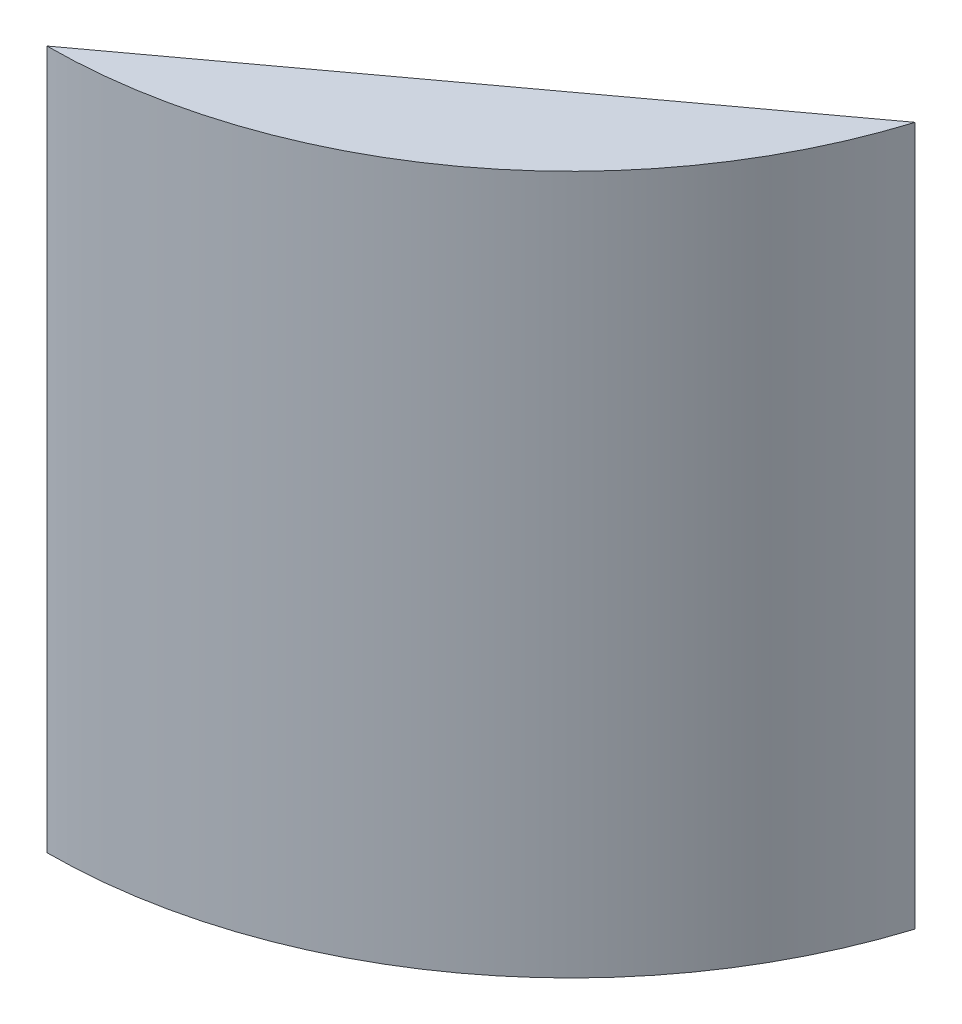
ISO-10303-21;
HEADER;
FILE_DESCRIPTION(('STEP AP214'),'2;1');
FILE_NAME('part.step','',(''),(''),'','','');
FILE_SCHEMA(('AUTOMOTIVE_DESIGN { 1 0 10303 214 1 1 1 1 }'));
ENDSEC;
DATA;
#1=APPLICATION_CONTEXT('core data for automotive mechanical design processes');
#2=APPLICATION_PROTOCOL_DEFINITION('international standard','automotive_design',2000,#1);
#3=PRODUCT_CONTEXT('',#1,'mechanical');
#4=PRODUCT('Part','Part','',(#3));
#5=PRODUCT_RELATED_PRODUCT_CATEGORY('part','',(#4));
#6=PRODUCT_DEFINITION_FORMATION('','',#4);
#7=PRODUCT_DEFINITION_CONTEXT('part definition',#1,'design');
#8=PRODUCT_DEFINITION('design','',#6,#7);
#9=PRODUCT_DEFINITION_SHAPE('','',#8);
#10=(LENGTH_UNIT() NAMED_UNIT(*) SI_UNIT(.MILLI.,.METRE.));
#11=(NAMED_UNIT(*) PLANE_ANGLE_UNIT() SI_UNIT($,.RADIAN.));
#12=(NAMED_UNIT(*) SI_UNIT($,.STERADIAN.) SOLID_ANGLE_UNIT());
#13=UNCERTAINTY_MEASURE_WITH_UNIT(LENGTH_MEASURE(1.E-05),#10,'distance_accuracy_value','');
#14=(GEOMETRIC_REPRESENTATION_CONTEXT(3) GLOBAL_UNCERTAINTY_ASSIGNED_CONTEXT((#13)) GLOBAL_UNIT_ASSIGNED_CONTEXT((#10,
#11,#12)) REPRESENTATION_CONTEXT('',''));
#15=CARTESIAN_POINT('',(0.,0.,0.));
#16=DIRECTION('',(0.,0.,1.));
#17=DIRECTION('',(1.,0.,0.));
#18=AXIS2_PLACEMENT_3D('',#15,#16,#17);
#19=CARTESIAN_POINT('',(0.,114.3,0.));
#20=DIRECTION('',(0.,-1.,0.));
#21=DIRECTION('',(0.,0.,-1.));
#22=AXIS2_PLACEMENT_3D('',#19,#20,#21);
#23=CYLINDRICAL_SURFACE('',#22,85.725);
#24=CARTESIAN_POINT('',(0.,114.3,0.));
#25=DIRECTION('',(0.,1.,0.));
#26=DIRECTION('',(0.,0.,1.));
#27=AXIS2_PLACEMENT_3D('',#24,#25,#26);
#28=CIRCLE('',#27,85.725);
#29=CARTESIAN_POINT('',(0.,114.3,85.725));
#30=VERTEX_POINT('',#29);
#31=CARTESIAN_POINT('',(81.8390377098757,114.3,25.5175925925926));
#32=VERTEX_POINT('',#31);
#33=EDGE_CURVE('E43',#30,#32,#28,.T.);
#34=ORIENTED_EDGE('',*,*,#33,.F.);
#35=DIRECTION('',(0.,1.,0.));
#36=VECTOR('',#35,1.);
#37=CARTESIAN_POINT('',(0.,-38.1,85.725));
#38=LINE('',#37,#36);
#39=CARTESIAN_POINT('',(0.,0.,85.725));
#40=VERTEX_POINT('',#39);
#41=EDGE_CURVE('E57',#40,#30,#38,.T.);
#42=ORIENTED_EDGE('',*,*,#41,.F.);
#43=CARTESIAN_POINT('',(0.,0.,0.));
#44=DIRECTION('',(0.,1.,0.));
#45=DIRECTION('',(0.,0.,1.));
#46=AXIS2_PLACEMENT_3D('',#43,#44,#45);
#47=CIRCLE('',#46,85.725);
#48=CARTESIAN_POINT('',(81.8390377098757,0.,25.5175925925926));
#49=VERTEX_POINT('',#48);
#50=EDGE_CURVE('E71',#40,#49,#47,.T.);
#51=ORIENTED_EDGE('',*,*,#50,.T.);
#52=DIRECTION('',(0.,1.,0.));
#53=VECTOR('',#52,1.);
#54=CARTESIAN_POINT('',(81.8390377098757,-38.1,25.5175925925926));
#55=LINE('',#54,#53);
#56=EDGE_CURVE('E50',#49,#32,#55,.T.);
#57=ORIENTED_EDGE('',*,*,#56,.T.);
#58=EDGE_LOOP('',(#34,#42,#51,#57));
#59=FACE_BOUND('',#58,.T.);
#60=ADVANCED_FACE('F36',(#59),#23,.T.);
#61=CARTESIAN_POINT('',(0.,114.3,0.));
#62=DIRECTION('',(0.,1.,0.));
#63=DIRECTION('',(0.,0.,1.));
#64=AXIS2_PLACEMENT_3D('',#61,#62,#63);
#65=PLANE('',#64);
#66=DIRECTION('',(0.805502339664131,0.,-0.592592592592593));
#67=VECTOR('',#66,1.);
#68=CARTESIAN_POINT('',(0.,114.3,85.725));
#69=LINE('',#68,#67);
#70=EDGE_CURVE('E60',#30,#32,#69,.T.);
#71=ORIENTED_EDGE('',*,*,#70,.F.);
#72=ORIENTED_EDGE('',*,*,#33,.T.);
#73=EDGE_LOOP('',(#71,#72));
#74=FACE_BOUND('',#73,.T.);
#75=ADVANCED_FACE('F68',(#74),#65,.T.);
#76=CARTESIAN_POINT('',(0.,0.,0.));
#77=DIRECTION('',(0.,1.,0.));
#78=DIRECTION('',(0.,0.,1.));
#79=AXIS2_PLACEMENT_3D('',#76,#77,#78);
#80=PLANE('',#79);
#81=CARTESIAN_POINT('',(45.8597594274689,0.,62.336492182002));
#82=DIRECTION('',(0.,-1.,0.));
#83=DIRECTION('',(0.,0.,-1.));
#84=AXIS2_PLACEMENT_3D('',#81,#82,#83);
#85=CIRCLE('',#84,5.588);
#86=CARTESIAN_POINT('',(45.8597594274689,0.,56.748492182002));
#87=VERTEX_POINT('',#86);
#88=EDGE_CURVE('E123',#87,#87,#85,.T.);
#89=ORIENTED_EDGE('',*,*,#88,.F.);
#90=EDGE_LOOP('',(#89));
#91=FACE_BOUND('',#90,.T.);
#92=ORIENTED_EDGE('',*,*,#50,.F.);
#93=DIRECTION('',(0.805502339664131,0.,-0.592592592592593));
#94=VECTOR('',#93,1.);
#95=CARTESIAN_POINT('',(40.9195188549379,0.,55.6212962962963));
#96=LINE('',#95,#94);
#97=EDGE_CURVE('E11',#40,#49,#96,.T.);
#98=ORIENTED_EDGE('',*,*,#97,.T.);
#99=EDGE_LOOP('',(#92,#98));
#100=FACE_BOUND('',#99,.T.);
#101=ADVANCED_FACE('F138',(#91,#100),#80,.F.);
#102=CARTESIAN_POINT('',(0.,-38.1,85.725));
#103=DIRECTION('',(0.592592592592593,0.,0.805502339664131));
#104=DIRECTION('',(0.805502339664131,0.,-0.592592592592593));
#105=AXIS2_PLACEMENT_3D('',#102,#103,#104);
#106=PLANE('',#105);
#107=CARTESIAN_POINT('',(70.5861700247678,51.308,33.7961111111111));
#108=DIRECTION('',(-0.592592592592593,0.,-0.805502339664131));
#109=DIRECTION('',(-0.805502339664131,0.,0.592592592592593));
#110=AXIS2_PLACEMENT_3D('',#107,#108,#109);
#111=CIRCLE('',#110,2.778125);
#112=CARTESIAN_POINT('',(68.3483838373884,51.308,35.4424074074074));
#113=VERTEX_POINT('',#112);
#114=EDGE_CURVE('E93',#113,#113,#111,.T.);
#115=ORIENTED_EDGE('',*,*,#114,.F.);
#116=EDGE_LOOP('',(#115));
#117=FACE_BOUND('',#116,.T.);
#118=CARTESIAN_POINT('',(31.9172247068516,70.358,62.2441111111111));
#119=DIRECTION('',(-0.592592592592593,0.,-0.805502339664131));
#120=DIRECTION('',(-0.805502339664131,0.,0.592592592592593));
#121=AXIS2_PLACEMENT_3D('',#118,#119,#120);
#122=CIRCLE('',#121,2.778125);
#123=CARTESIAN_POINT('',(29.6794385194722,70.358,63.8904074074074));
#124=VERTEX_POINT('',#123);
#125=EDGE_CURVE('E100',#124,#124,#122,.T.);
#126=ORIENTED_EDGE('',*,*,#125,.F.);
#127=EDGE_LOOP('',(#126));
#128=FACE_BOUND('',#127,.T.);
#129=CARTESIAN_POINT('',(70.5861700247679,70.358,33.7961111111111));
#130=DIRECTION('',(-0.592592592592593,0.,-0.805502339664131));
#131=DIRECTION('',(-0.805502339664131,0.,0.592592592592593));
#132=AXIS2_PLACEMENT_3D('',#129,#130,#131);
#133=CIRCLE('',#132,2.778125);
#134=CARTESIAN_POINT('',(68.3483838373884,70.358,35.4424074074074));
#135=VERTEX_POINT('',#134);
#136=EDGE_CURVE('E81',#135,#135,#133,.T.);
#137=ORIENTED_EDGE('',*,*,#136,.F.);
#138=EDGE_LOOP('',(#137));
#139=FACE_BOUND('',#138,.T.);
#140=CARTESIAN_POINT('',(31.9172247068516,95.758,62.2441111111111));
#141=DIRECTION('',(-0.592592592592593,0.,-0.805502339664131));
#142=DIRECTION('',(-0.805502339664131,0.,0.592592592592593));
#143=AXIS2_PLACEMENT_3D('',#140,#141,#142);
#144=CIRCLE('',#143,2.778125);
#145=CARTESIAN_POINT('',(29.6794385194721,95.758,63.8904074074074));
#146=VERTEX_POINT('',#145);
#147=EDGE_CURVE('E88',#146,#146,#144,.T.);
#148=ORIENTED_EDGE('',*,*,#147,.F.);
#149=EDGE_LOOP('',(#148));
#150=FACE_BOUND('',#149,.T.);
#151=CARTESIAN_POINT('',(36.0091765923453,30.48,59.2337407407408));
#152=DIRECTION('',(-0.592592592592593,0.,-0.805502339664131));
#153=DIRECTION('',(-0.805502339664131,0.,0.592592592592593));
#154=AXIS2_PLACEMENT_3D('',#151,#152,#153);
#155=CIRCLE('',#154,2.778125);
#156=CARTESIAN_POINT('',(33.7713904049659,30.48,60.880037037037));
#157=VERTEX_POINT('',#156);
#158=EDGE_CURVE('E117',#157,#157,#155,.T.);
#159=ORIENTED_EDGE('',*,*,#158,.F.);
#160=EDGE_LOOP('',(#159));
#161=FACE_BOUND('',#160,.T.);
#162=CARTESIAN_POINT('',(70.5861700247678,30.48,33.7961111111111));
#163=DIRECTION('',(-0.592592592592593,0.,-0.805502339664131));
#164=DIRECTION('',(-0.805502339664131,0.,0.592592592592593));
#165=AXIS2_PLACEMENT_3D('',#162,#163,#164);
#166=CIRCLE('',#165,2.77812499999999);
#167=CARTESIAN_POINT('',(68.3483838373884,30.48,35.4424074074074));
#168=VERTEX_POINT('',#167);
#169=EDGE_CURVE('E105',#168,#168,#166,.T.);
#170=ORIENTED_EDGE('',*,*,#169,.F.);
#171=EDGE_LOOP('',(#170));
#172=FACE_BOUND('',#171,.T.);
#173=CARTESIAN_POINT('',(36.0091765923453,51.308,59.2337407407408));
#174=DIRECTION('',(-0.592592592592593,0.,-0.805502339664131));
#175=DIRECTION('',(-0.805502339664131,0.,0.592592592592593));
#176=AXIS2_PLACEMENT_3D('',#173,#174,#175);
#177=CIRCLE('',#176,2.778125);
#178=CARTESIAN_POINT('',(33.7713904049659,51.308,60.8800370370371));
#179=VERTEX_POINT('',#178);
#180=EDGE_CURVE('E112',#179,#179,#177,.T.);
#181=ORIENTED_EDGE('',*,*,#180,.F.);
#182=EDGE_LOOP('',(#181));
#183=FACE_BOUND('',#182,.T.);
#184=CARTESIAN_POINT('',(70.5861700247678,95.758,33.7961111111111));
#185=DIRECTION('',(-0.592592592592593,0.,-0.805502339664131));
#186=DIRECTION('',(-0.805502339664131,0.,0.592592592592593));
#187=AXIS2_PLACEMENT_3D('',#184,#185,#186);
#188=CIRCLE('',#187,2.77812499999999);
#189=CARTESIAN_POINT('',(68.3483838373884,95.758,35.4424074074074));
#190=VERTEX_POINT('',#189);
#191=EDGE_CURVE('E75',#190,#190,#188,.T.);
#192=ORIENTED_EDGE('',*,*,#191,.F.);
#193=EDGE_LOOP('',(#192));
#194=FACE_BOUND('',#193,.T.);
#195=ORIENTED_EDGE('',*,*,#41,.T.);
#196=ORIENTED_EDGE('',*,*,#70,.T.);
#197=ORIENTED_EDGE('',*,*,#56,.F.);
#198=ORIENTED_EDGE('',*,*,#97,.F.);
#199=EDGE_LOOP('',(#195,#196,#197,#198));
#200=FACE_BOUND('',#199,.T.);
#201=ADVANCED_FACE('F59',(#117,#128,#139,#150,#161,#172,#183,#194,#200),#106,.F.);
#202=CARTESIAN_POINT('',(72.4676515062493,95.758,36.3535810395447));
#203=DIRECTION('',(-0.592592592592593,0.,-0.805502339664131));
#204=DIRECTION('',(-0.805502339664131,0.,0.592592592592593));
#205=AXIS2_PLACEMENT_3D('',#202,#203,#204);
#206=CYLINDRICAL_SURFACE('',#205,2.77812499999999);
#207=CARTESIAN_POINT('',(72.4676515062493,95.758,36.3535810395447));
#208=DIRECTION('',(-0.592592592592593,0.,-0.805502339664131));
#209=DIRECTION('',(-0.805502339664131,0.,0.592592592592593));
#210=AXIS2_PLACEMENT_3D('',#207,#208,#209);
#211=CIRCLE('',#210,2.77812499999999);
#212=CARTESIAN_POINT('',(70.2298653188699,95.758,37.999877335841));
#213=VERTEX_POINT('',#212);
#214=EDGE_CURVE('E69',#213,#213,#211,.T.);
#215=ORIENTED_EDGE('',*,*,#214,.F.);
#216=EDGE_LOOP('',(#215));
#217=FACE_BOUND('',#216,.T.);
#218=ORIENTED_EDGE('',*,*,#191,.T.);
#219=EDGE_LOOP('',(#218));
#220=FACE_BOUND('',#219,.T.);
#221=ADVANCED_FACE('F145',(#217,#220),#206,.F.);
#222=CARTESIAN_POINT('',(72.4676515062493,95.758,36.3535810395447));
#223=DIRECTION('',(-0.592592592592593,0.,-0.805502339664131));
#224=DIRECTION('',(-0.805502339664131,0.,0.592592592592593));
#225=AXIS2_PLACEMENT_3D('',#222,#223,#224);
#226=PLANE('',#225);
#227=ORIENTED_EDGE('',*,*,#214,.T.);
#228=EDGE_LOOP('',(#227));
#229=FACE_BOUND('',#228,.T.);
#230=ADVANCED_FACE('F172',(#229),#226,.T.);
#231=CARTESIAN_POINT('',(37.8906580738268,51.308,61.7912106691744));
#232=DIRECTION('',(-0.592592592592593,0.,-0.805502339664131));
#233=DIRECTION('',(-0.805502339664131,0.,0.592592592592593));
#234=AXIS2_PLACEMENT_3D('',#231,#232,#233);
#235=CYLINDRICAL_SURFACE('',#234,2.778125);
#236=CARTESIAN_POINT('',(37.8906580738268,51.308,61.7912106691744));
#237=DIRECTION('',(-0.592592592592593,0.,-0.805502339664131));
#238=DIRECTION('',(-0.805502339664131,0.,0.592592592592593));
#239=AXIS2_PLACEMENT_3D('',#236,#237,#238);
#240=CIRCLE('',#239,2.778125);
#241=CARTESIAN_POINT('',(35.6528718864474,51.308,63.4375069654707));
#242=VERTEX_POINT('',#241);
#243=EDGE_CURVE('E97',#242,#242,#240,.T.);
#244=ORIENTED_EDGE('',*,*,#243,.F.);
#245=EDGE_LOOP('',(#244));
#246=FACE_BOUND('',#245,.T.);
#247=ORIENTED_EDGE('',*,*,#180,.T.);
#248=EDGE_LOOP('',(#247));
#249=FACE_BOUND('',#248,.T.);
#250=ADVANCED_FACE('F182',(#246,#249),#235,.F.);
#251=CARTESIAN_POINT('',(37.8906580738268,51.308,61.7912106691744));
#252=DIRECTION('',(-0.592592592592593,0.,-0.805502339664131));
#253=DIRECTION('',(-0.805502339664131,0.,0.592592592592593));
#254=AXIS2_PLACEMENT_3D('',#251,#252,#253);
#255=PLANE('',#254);
#256=ORIENTED_EDGE('',*,*,#243,.T.);
#257=EDGE_LOOP('',(#256));
#258=FACE_BOUND('',#257,.T.);
#259=ADVANCED_FACE('F192',(#258),#255,.T.);
#260=CARTESIAN_POINT('',(72.4676515062493,30.48,36.3535810395447));
#261=DIRECTION('',(-0.592592592592593,0.,-0.805502339664131));
#262=DIRECTION('',(-0.805502339664131,0.,0.592592592592593));
#263=AXIS2_PLACEMENT_3D('',#260,#261,#262);
#264=CYLINDRICAL_SURFACE('',#263,2.77812499999999);
#265=CARTESIAN_POINT('',(72.4676515062493,30.48,36.3535810395447));
#266=DIRECTION('',(-0.592592592592593,0.,-0.805502339664131));
#267=DIRECTION('',(-0.805502339664131,0.,0.592592592592593));
#268=AXIS2_PLACEMENT_3D('',#265,#266,#267);
#269=CIRCLE('',#268,2.77812499999999);
#270=CARTESIAN_POINT('',(70.2298653188699,30.48,37.999877335841));
#271=VERTEX_POINT('',#270);
#272=EDGE_CURVE('E108',#271,#271,#269,.T.);
#273=ORIENTED_EDGE('',*,*,#272,.F.);
#274=EDGE_LOOP('',(#273));
#275=FACE_BOUND('',#274,.T.);
#276=ORIENTED_EDGE('',*,*,#169,.T.);
#277=EDGE_LOOP('',(#276));
#278=FACE_BOUND('',#277,.T.);
#279=ADVANCED_FACE('F202',(#275,#278),#264,.F.);
#280=CARTESIAN_POINT('',(72.4676515062493,30.48,36.3535810395447));
#281=DIRECTION('',(-0.592592592592593,0.,-0.805502339664131));
#282=DIRECTION('',(-0.805502339664131,0.,0.592592592592593));
#283=AXIS2_PLACEMENT_3D('',#280,#281,#282);
#284=PLANE('',#283);
#285=ORIENTED_EDGE('',*,*,#272,.T.);
#286=EDGE_LOOP('',(#285));
#287=FACE_BOUND('',#286,.T.);
#288=ADVANCED_FACE('F212',(#287),#284,.T.);
#289=CARTESIAN_POINT('',(37.8906580738268,30.48,61.7912106691744));
#290=DIRECTION('',(-0.592592592592593,0.,-0.805502339664131));
#291=DIRECTION('',(-0.805502339664131,0.,0.592592592592593));
#292=AXIS2_PLACEMENT_3D('',#289,#290,#291);
#293=CYLINDRICAL_SURFACE('',#292,2.778125);
#294=CARTESIAN_POINT('',(37.8906580738268,30.48,61.7912106691744));
#295=DIRECTION('',(-0.592592592592593,0.,-0.805502339664131));
#296=DIRECTION('',(-0.805502339664131,0.,0.592592592592593));
#297=AXIS2_PLACEMENT_3D('',#294,#295,#296);
#298=CIRCLE('',#297,2.778125);
#299=CARTESIAN_POINT('',(35.6528718864474,30.48,63.4375069654707));
#300=VERTEX_POINT('',#299);
#301=EDGE_CURVE('E109',#300,#300,#298,.T.);
#302=ORIENTED_EDGE('',*,*,#301,.F.);
#303=EDGE_LOOP('',(#302));
#304=FACE_BOUND('',#303,.T.);
#305=ORIENTED_EDGE('',*,*,#158,.T.);
#306=EDGE_LOOP('',(#305));
#307=FACE_BOUND('',#306,.T.);
#308=ADVANCED_FACE('F222',(#304,#307),#293,.F.);
#309=CARTESIAN_POINT('',(37.8906580738268,30.48,61.7912106691744));
#310=DIRECTION('',(-0.592592592592593,0.,-0.805502339664131));
#311=DIRECTION('',(-0.805502339664131,0.,0.592592592592593));
#312=AXIS2_PLACEMENT_3D('',#309,#310,#311);
#313=PLANE('',#312);
#314=ORIENTED_EDGE('',*,*,#301,.T.);
#315=EDGE_LOOP('',(#314));
#316=FACE_BOUND('',#315,.T.);
#317=ADVANCED_FACE('F232',(#316),#313,.T.);
#318=CARTESIAN_POINT('',(33.798706188333,95.758,64.8015810395448));
#319=DIRECTION('',(-0.592592592592593,0.,-0.805502339664131));
#320=DIRECTION('',(-0.805502339664131,0.,0.592592592592593));
#321=AXIS2_PLACEMENT_3D('',#318,#319,#320);
#322=CYLINDRICAL_SURFACE('',#321,2.778125);
#323=CARTESIAN_POINT('',(33.798706188333,95.758,64.8015810395448));
#324=DIRECTION('',(-0.592592592592593,0.,-0.805502339664131));
#325=DIRECTION('',(-0.805502339664131,0.,0.592592592592593));
#326=AXIS2_PLACEMENT_3D('',#323,#324,#325);
#327=CIRCLE('',#326,2.778125);
#328=CARTESIAN_POINT('',(31.5609200009536,95.758,66.4478773358411));
#329=VERTEX_POINT('',#328);
#330=EDGE_CURVE('E78',#329,#329,#327,.T.);
#331=ORIENTED_EDGE('',*,*,#330,.F.);
#332=EDGE_LOOP('',(#331));
#333=FACE_BOUND('',#332,.T.);
#334=ORIENTED_EDGE('',*,*,#147,.T.);
#335=EDGE_LOOP('',(#334));
#336=FACE_BOUND('',#335,.T.);
#337=ADVANCED_FACE('F242',(#333,#336),#322,.F.);
#338=CARTESIAN_POINT('',(33.798706188333,95.758,64.8015810395448));
#339=DIRECTION('',(-0.592592592592593,0.,-0.805502339664131));
#340=DIRECTION('',(-0.805502339664131,0.,0.592592592592593));
#341=AXIS2_PLACEMENT_3D('',#338,#339,#340);
#342=PLANE('',#341);
#343=ORIENTED_EDGE('',*,*,#330,.T.);
#344=EDGE_LOOP('',(#343));
#345=FACE_BOUND('',#344,.T.);
#346=ADVANCED_FACE('F252',(#345),#342,.T.);
#347=CARTESIAN_POINT('',(72.4676515062493,70.358,36.3535810395447));
#348=DIRECTION('',(-0.592592592592593,0.,-0.805502339664131));
#349=DIRECTION('',(-0.805502339664131,0.,0.592592592592593));
#350=AXIS2_PLACEMENT_3D('',#347,#348,#349);
#351=CYLINDRICAL_SURFACE('',#350,2.778125);
#352=CARTESIAN_POINT('',(72.4676515062493,70.358,36.3535810395447));
#353=DIRECTION('',(-0.592592592592593,0.,-0.805502339664131));
#354=DIRECTION('',(-0.805502339664131,0.,0.592592592592593));
#355=AXIS2_PLACEMENT_3D('',#352,#353,#354);
#356=CIRCLE('',#355,2.778125);
#357=CARTESIAN_POINT('',(70.2298653188699,70.358,37.999877335841));
#358=VERTEX_POINT('',#357);
#359=EDGE_CURVE('E84',#358,#358,#356,.T.);
#360=ORIENTED_EDGE('',*,*,#359,.F.);
#361=EDGE_LOOP('',(#360));
#362=FACE_BOUND('',#361,.T.);
#363=ORIENTED_EDGE('',*,*,#136,.T.);
#364=EDGE_LOOP('',(#363));
#365=FACE_BOUND('',#364,.T.);
#366=ADVANCED_FACE('F262',(#362,#365),#351,.F.);
#367=CARTESIAN_POINT('',(72.4676515062493,70.358,36.3535810395447));
#368=DIRECTION('',(-0.592592592592593,0.,-0.805502339664131));
#369=DIRECTION('',(-0.805502339664131,0.,0.592592592592593));
#370=AXIS2_PLACEMENT_3D('',#367,#368,#369);
#371=PLANE('',#370);
#372=ORIENTED_EDGE('',*,*,#359,.T.);
#373=EDGE_LOOP('',(#372));
#374=FACE_BOUND('',#373,.T.);
#375=ADVANCED_FACE('F272',(#374),#371,.T.);
#376=CARTESIAN_POINT('',(33.7987061883331,70.358,64.8015810395447));
#377=DIRECTION('',(-0.592592592592593,0.,-0.805502339664131));
#378=DIRECTION('',(-0.805502339664131,0.,0.592592592592593));
#379=AXIS2_PLACEMENT_3D('',#376,#377,#378);
#380=CYLINDRICAL_SURFACE('',#379,2.778125);
#381=CARTESIAN_POINT('',(33.7987061883331,70.358,64.8015810395447));
#382=DIRECTION('',(-0.592592592592593,0.,-0.805502339664131));
#383=DIRECTION('',(-0.805502339664131,0.,0.592592592592593));
#384=AXIS2_PLACEMENT_3D('',#381,#382,#383);
#385=CIRCLE('',#384,2.778125);
#386=CARTESIAN_POINT('',(31.5609200009536,70.358,66.447877335841));
#387=VERTEX_POINT('',#386);
#388=EDGE_CURVE('E85',#387,#387,#385,.T.);
#389=ORIENTED_EDGE('',*,*,#388,.F.);
#390=EDGE_LOOP('',(#389));
#391=FACE_BOUND('',#390,.T.);
#392=ORIENTED_EDGE('',*,*,#125,.T.);
#393=EDGE_LOOP('',(#392));
#394=FACE_BOUND('',#393,.T.);
#395=ADVANCED_FACE('F282',(#391,#394),#380,.F.);
#396=CARTESIAN_POINT('',(33.7987061883331,70.358,64.8015810395447));
#397=DIRECTION('',(-0.592592592592593,0.,-0.805502339664131));
#398=DIRECTION('',(-0.805502339664131,0.,0.592592592592593));
#399=AXIS2_PLACEMENT_3D('',#396,#397,#398);
#400=PLANE('',#399);
#401=ORIENTED_EDGE('',*,*,#388,.T.);
#402=EDGE_LOOP('',(#401));
#403=FACE_BOUND('',#402,.T.);
#404=ADVANCED_FACE('F292',(#403),#400,.T.);
#405=CARTESIAN_POINT('',(72.4676515062493,51.308,36.3535810395447));
#406=DIRECTION('',(-0.592592592592593,0.,-0.805502339664131));
#407=DIRECTION('',(-0.805502339664131,0.,0.592592592592593));
#408=AXIS2_PLACEMENT_3D('',#405,#406,#407);
#409=CYLINDRICAL_SURFACE('',#408,2.778125);
#410=CARTESIAN_POINT('',(72.4676515062493,51.308,36.3535810395447));
#411=DIRECTION('',(-0.592592592592593,0.,-0.805502339664131));
#412=DIRECTION('',(-0.805502339664131,0.,0.592592592592593));
#413=AXIS2_PLACEMENT_3D('',#410,#411,#412);
#414=CIRCLE('',#413,2.778125);
#415=CARTESIAN_POINT('',(70.2298653188699,51.308,37.999877335841));
#416=VERTEX_POINT('',#415);
#417=EDGE_CURVE('E96',#416,#416,#414,.T.);
#418=ORIENTED_EDGE('',*,*,#417,.F.);
#419=EDGE_LOOP('',(#418));
#420=FACE_BOUND('',#419,.T.);
#421=ORIENTED_EDGE('',*,*,#114,.T.);
#422=EDGE_LOOP('',(#421));
#423=FACE_BOUND('',#422,.T.);
#424=ADVANCED_FACE('F302',(#420,#423),#409,.F.);
#425=CARTESIAN_POINT('',(72.4676515062493,51.308,36.3535810395447));
#426=DIRECTION('',(-0.592592592592593,0.,-0.805502339664131));
#427=DIRECTION('',(-0.805502339664131,0.,0.592592592592593));
#428=AXIS2_PLACEMENT_3D('',#425,#426,#427);
#429=PLANE('',#428);
#430=ORIENTED_EDGE('',*,*,#417,.T.);
#431=EDGE_LOOP('',(#430));
#432=FACE_BOUND('',#431,.T.);
#433=ADVANCED_FACE('F134',(#432),#429,.T.);
#434=CARTESIAN_POINT('',(45.8597594274689,6.096,62.336492182002));
#435=DIRECTION('',(0.,-1.,0.));
#436=DIRECTION('',(0.,0.,-1.));
#437=AXIS2_PLACEMENT_3D('',#434,#435,#436);
#438=CYLINDRICAL_SURFACE('',#437,5.588);
#439=CARTESIAN_POINT('',(45.8597594274689,6.096,62.336492182002));
#440=DIRECTION('',(0.,-1.,0.));
#441=DIRECTION('',(0.,0.,-1.));
#442=AXIS2_PLACEMENT_3D('',#439,#440,#441);
#443=CIRCLE('',#442,5.588);
#444=CARTESIAN_POINT('',(45.8597594274689,6.096,56.748492182002));
#445=VERTEX_POINT('',#444);
#446=EDGE_CURVE('E120',#445,#445,#443,.T.);
#447=ORIENTED_EDGE('',*,*,#446,.F.);
#448=EDGE_LOOP('',(#447));
#449=FACE_BOUND('',#448,.T.);
#450=ORIENTED_EDGE('',*,*,#88,.T.);
#451=EDGE_LOOP('',(#450));
#452=FACE_BOUND('',#451,.T.);
#453=ADVANCED_FACE('F131',(#449,#452),#438,.F.);
#454=CARTESIAN_POINT('',(45.8597594274689,6.096,62.336492182002));
#455=DIRECTION('',(0.,-1.,0.));
#456=DIRECTION('',(0.,0.,-1.));
#457=AXIS2_PLACEMENT_3D('',#454,#455,#456);
#458=PLANE('',#457);
#459=ORIENTED_EDGE('',*,*,#446,.T.);
#460=EDGE_LOOP('',(#459));
#461=FACE_BOUND('',#460,.T.);
#462=ADVANCED_FACE('F129',(#461),#458,.T.);
#463=CLOSED_SHELL('',(#60,#75,#101,#201,#221,#230,#250,#259,#279,#288,#308,#317,#337,#346,#366,
#375,#395,#404,#424,#433,#453,#462));
#464=MANIFOLD_SOLID_BREP('B2',#463);
#465=ADVANCED_BREP_SHAPE_REPRESENTATION('',(#18,#464),#14);
#466=SHAPE_DEFINITION_REPRESENTATION(#9,#465);
ENDSEC;
END-ISO-10303-21;
